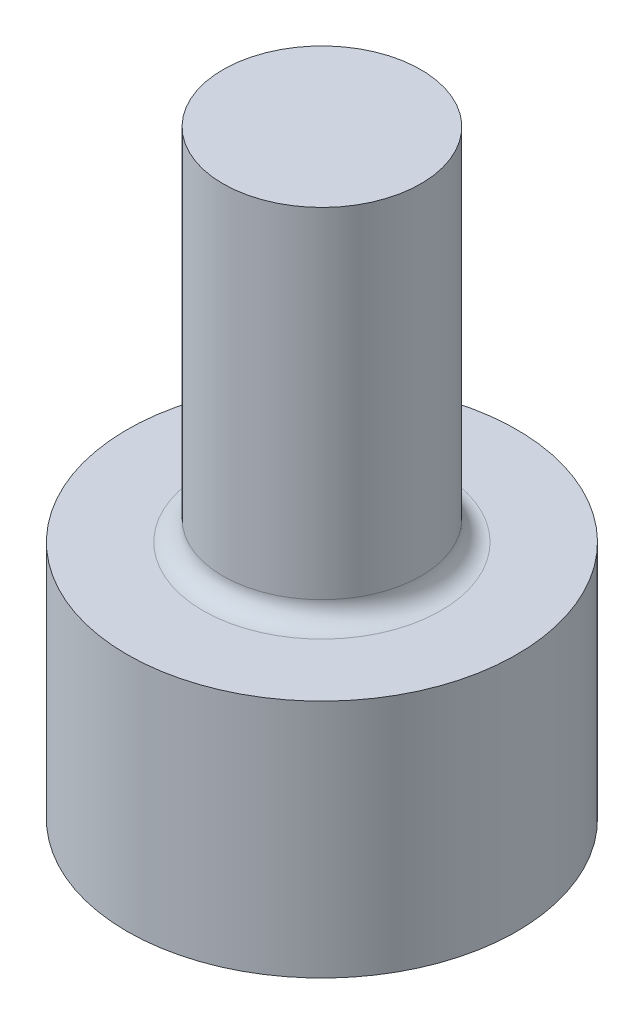
ISO-10303-21;
HEADER;
FILE_DESCRIPTION(('STEP AP214'),'2;1');
FILE_NAME('part.step','',(''),(''),'','','');
FILE_SCHEMA(('AUTOMOTIVE_DESIGN { 1 0 10303 214 1 1 1 1 }'));
ENDSEC;
DATA;
#1=APPLICATION_CONTEXT('core data for automotive mechanical design processes');
#2=APPLICATION_PROTOCOL_DEFINITION('international standard','automotive_design',2000,#1);
#3=PRODUCT_CONTEXT('',#1,'mechanical');
#4=PRODUCT('Part','Part','',(#3));
#5=PRODUCT_RELATED_PRODUCT_CATEGORY('part','',(#4));
#6=PRODUCT_DEFINITION_FORMATION('','',#4);
#7=PRODUCT_DEFINITION_CONTEXT('part definition',#1,'design');
#8=PRODUCT_DEFINITION('design','',#6,#7);
#9=PRODUCT_DEFINITION_SHAPE('','',#8);
#10=(LENGTH_UNIT() NAMED_UNIT(*) SI_UNIT(.MILLI.,.METRE.));
#11=(NAMED_UNIT(*) PLANE_ANGLE_UNIT() SI_UNIT($,.RADIAN.));
#12=(NAMED_UNIT(*) SI_UNIT($,.STERADIAN.) SOLID_ANGLE_UNIT());
#13=UNCERTAINTY_MEASURE_WITH_UNIT(LENGTH_MEASURE(1.E-05),#10,'distance_accuracy_value','');
#14=(GEOMETRIC_REPRESENTATION_CONTEXT(3) GLOBAL_UNCERTAINTY_ASSIGNED_CONTEXT((#13)) GLOBAL_UNIT_ASSIGNED_CONTEXT((#10,
#11,#12)) REPRESENTATION_CONTEXT('',''));
#15=CARTESIAN_POINT('',(0.,0.,0.));
#16=DIRECTION('',(0.,0.,1.));
#17=DIRECTION('',(1.,0.,0.));
#18=AXIS2_PLACEMENT_3D('',#15,#16,#17);
#19=CARTESIAN_POINT('',(0.,6.,0.));
#20=DIRECTION('',(0.,1.,0.));
#21=DIRECTION('',(0.,0.,1.));
#22=AXIS2_PLACEMENT_3D('',#19,#20,#21);
#23=PLANE('',#22);
#24=CARTESIAN_POINT('',(0.,6.,0.));
#25=DIRECTION('',(0.,1.,0.));
#26=DIRECTION('',(0.,0.,1.));
#27=AXIS2_PLACEMENT_3D('',#24,#25,#26);
#28=CIRCLE('',#27,2.975);
#29=CARTESIAN_POINT('',(0.,6.,2.975));
#30=VERTEX_POINT('',#29);
#31=EDGE_CURVE('E10',#30,#30,#28,.F.);
#32=ORIENTED_EDGE('',*,*,#31,.T.);
#33=EDGE_LOOP('',(#32));
#34=FACE_BOUND('',#33,.T.);
#35=CARTESIAN_POINT('',(0.,6.,0.));
#36=DIRECTION('',(0.,1.,0.));
#37=DIRECTION('',(0.,0.,1.));
#38=AXIS2_PLACEMENT_3D('',#35,#36,#37);
#39=CIRCLE('',#38,4.875);
#40=CARTESIAN_POINT('',(0.,6.,4.875));
#41=VERTEX_POINT('',#40);
#42=EDGE_CURVE('E54',#41,#41,#39,.T.);
#43=ORIENTED_EDGE('',*,*,#42,.T.);
#44=EDGE_LOOP('',(#43));
#45=FACE_BOUND('',#44,.T.);
#46=ADVANCED_FACE('F41',(#34,#45),#23,.T.);
#47=CARTESIAN_POINT('',(0.,0.,0.));
#48=DIRECTION('',(0.,1.,0.));
#49=DIRECTION('',(0.,0.,1.));
#50=AXIS2_PLACEMENT_3D('',#47,#48,#49);
#51=PLANE('',#50);
#52=CARTESIAN_POINT('',(0.,0.,0.));
#53=DIRECTION('',(0.,1.,0.));
#54=DIRECTION('',(0.,0.,1.));
#55=AXIS2_PLACEMENT_3D('',#52,#53,#54);
#56=CIRCLE('',#55,4.875);
#57=CARTESIAN_POINT('',(0.,0.,4.875));
#58=VERTEX_POINT('',#57);
#59=EDGE_CURVE('E59',#58,#58,#56,.T.);
#60=ORIENTED_EDGE('',*,*,#59,.F.);
#61=EDGE_LOOP('',(#60));
#62=FACE_BOUND('',#61,.T.);
#63=CARTESIAN_POINT('',(0.,0.,0.));
#64=DIRECTION('',(0.,1.,0.));
#65=DIRECTION('',(0.,0.,1.));
#66=AXIS2_PLACEMENT_3D('',#63,#64,#65);
#67=CIRCLE('',#66,1.875);
#68=CARTESIAN_POINT('',(0.,0.,1.875));
#69=VERTEX_POINT('',#68);
#70=EDGE_CURVE('E64',#69,#69,#67,.T.);
#71=ORIENTED_EDGE('',*,*,#70,.T.);
#72=EDGE_LOOP('',(#71));
#73=FACE_BOUND('',#72,.T.);
#74=ADVANCED_FACE('F94',(#62,#73),#51,.F.);
#75=CARTESIAN_POINT('',(0.,6.,0.));
#76=DIRECTION('',(0.,-1.,0.));
#77=DIRECTION('',(0.,0.,-1.));
#78=AXIS2_PLACEMENT_3D('',#75,#76,#77);
#79=CYLINDRICAL_SURFACE('',#78,4.875);
#80=ORIENTED_EDGE('',*,*,#42,.F.);
#81=EDGE_LOOP('',(#80));
#82=FACE_BOUND('',#81,.T.);
#83=ORIENTED_EDGE('',*,*,#59,.T.);
#84=EDGE_LOOP('',(#83));
#85=FACE_BOUND('',#84,.T.);
#86=ADVANCED_FACE('F99',(#82,#85),#79,.T.);
#87=CARTESIAN_POINT('',(0.,6.,0.));
#88=DIRECTION('',(0.,-1.,0.));
#89=DIRECTION('',(0.,0.,-1.));
#90=AXIS2_PLACEMENT_3D('',#87,#88,#89);
#91=CYLINDRICAL_SURFACE('',#90,1.875);
#92=CARTESIAN_POINT('',(0.,6.,0.));
#93=DIRECTION('',(0.,1.,0.));
#94=DIRECTION('',(0.,0.,1.));
#95=AXIS2_PLACEMENT_3D('',#92,#93,#94);
#96=CIRCLE('',#95,1.875);
#97=CARTESIAN_POINT('',(0.,6.,1.875));
#98=VERTEX_POINT('',#97);
#99=EDGE_CURVE('E69',#98,#98,#96,.T.);
#100=ORIENTED_EDGE('',*,*,#99,.T.);
#101=EDGE_LOOP('',(#100));
#102=FACE_BOUND('',#101,.T.);
#103=ORIENTED_EDGE('',*,*,#70,.F.);
#104=EDGE_LOOP('',(#103));
#105=FACE_BOUND('',#104,.T.);
#106=ADVANCED_FACE('F89',(#102,#105),#91,.F.);
#107=CARTESIAN_POINT('',(0.,6.,0.));
#108=DIRECTION('',(0.,1.,0.));
#109=DIRECTION('',(0.,0.,1.));
#110=AXIS2_PLACEMENT_3D('',#107,#108,#109);
#111=PLANE('',#110);
#112=ORIENTED_EDGE('',*,*,#99,.F.);
#113=EDGE_LOOP('',(#112));
#114=FACE_BOUND('',#113,.T.);
#115=ADVANCED_FACE('F82',(#114),#111,.F.);
#116=CARTESIAN_POINT('',(0.,15.,0.));
#117=DIRECTION('',(0.,-1.,0.));
#118=DIRECTION('',(0.,0.,-1.));
#119=AXIS2_PLACEMENT_3D('',#116,#117,#118);
#120=CYLINDRICAL_SURFACE('',#119,2.475);
#121=CARTESIAN_POINT('',(0.,6.5,0.));
#122=DIRECTION('',(0.,1.,0.));
#123=DIRECTION('',(0.,0.,1.));
#124=AXIS2_PLACEMENT_3D('',#121,#122,#123);
#125=CIRCLE('',#124,2.475);
#126=CARTESIAN_POINT('',(0.,6.5,2.475));
#127=VERTEX_POINT('',#126);
#128=EDGE_CURVE('E49',#127,#127,#125,.T.);
#129=ORIENTED_EDGE('',*,*,#128,.T.);
#130=EDGE_LOOP('',(#129));
#131=FACE_BOUND('',#130,.T.);
#132=CARTESIAN_POINT('',(0.,15.,0.));
#133=DIRECTION('',(0.,1.,0.));
#134=DIRECTION('',(0.,0.,1.));
#135=AXIS2_PLACEMENT_3D('',#132,#133,#134);
#136=CIRCLE('',#135,2.475);
#137=CARTESIAN_POINT('',(0.,15.,2.475));
#138=VERTEX_POINT('',#137);
#139=EDGE_CURVE('E73',#138,#138,#136,.T.);
#140=ORIENTED_EDGE('',*,*,#139,.F.);
#141=EDGE_LOOP('',(#140));
#142=FACE_BOUND('',#141,.T.);
#143=ADVANCED_FACE('F80',(#131,#142),#120,.T.);
#144=CARTESIAN_POINT('',(0.,15.,0.));
#145=DIRECTION('',(0.,1.,0.));
#146=DIRECTION('',(0.,0.,1.));
#147=AXIS2_PLACEMENT_3D('',#144,#145,#146);
#148=PLANE('',#147);
#149=ORIENTED_EDGE('',*,*,#139,.T.);
#150=EDGE_LOOP('',(#149));
#151=FACE_BOUND('',#150,.T.);
#152=ADVANCED_FACE('F78',(#151),#148,.T.);
#153=CARTESIAN_POINT('',(0.,6.5,0.));
#154=DIRECTION('',(0.,1.,0.));
#155=DIRECTION('',(0.,0.,1.));
#156=AXIS2_PLACEMENT_3D('',#153,#154,#155);
#157=TOROIDAL_SURFACE('',#156,2.975,0.5);
#158=ORIENTED_EDGE('',*,*,#31,.F.);
#159=EDGE_LOOP('',(#158));
#160=FACE_BOUND('',#159,.T.);
#161=ORIENTED_EDGE('',*,*,#128,.F.);
#162=EDGE_LOOP('',(#161));
#163=FACE_BOUND('',#162,.T.);
#164=ADVANCED_FACE('F43',(#160,#163),#157,.F.);
#165=CLOSED_SHELL('',(#46,#74,#86,#106,#115,#143,#152,#164));
#166=MANIFOLD_SOLID_BREP('B2',#165);
#167=ADVANCED_BREP_SHAPE_REPRESENTATION('',(#18,#166),#14);
#168=SHAPE_DEFINITION_REPRESENTATION(#9,#167);
ENDSEC;
END-ISO-10303-21;
